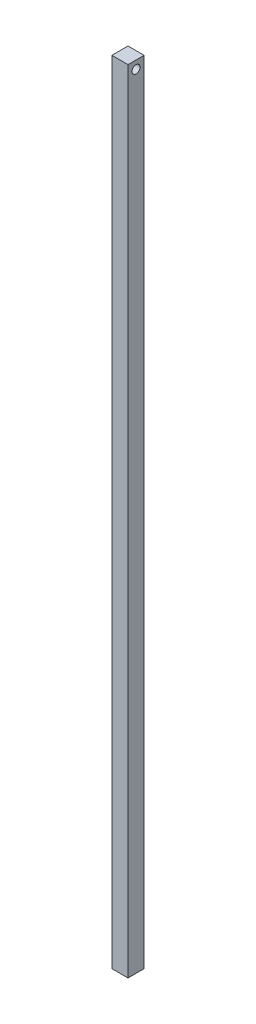
ISO-10303-21;
HEADER;
FILE_DESCRIPTION(('STEP AP214'),'2;1');
FILE_NAME('part.step','',(''),(''),'','','');
FILE_SCHEMA(('AUTOMOTIVE_DESIGN { 1 0 10303 214 1 1 1 1 }'));
ENDSEC;
DATA;
#1=APPLICATION_CONTEXT('core data for automotive mechanical design processes');
#2=APPLICATION_PROTOCOL_DEFINITION('international standard','automotive_design',2000,#1);
#3=PRODUCT_CONTEXT('',#1,'mechanical');
#4=PRODUCT('Part','Part','',(#3));
#5=PRODUCT_RELATED_PRODUCT_CATEGORY('part','',(#4));
#6=PRODUCT_DEFINITION_FORMATION('','',#4);
#7=PRODUCT_DEFINITION_CONTEXT('part definition',#1,'design');
#8=PRODUCT_DEFINITION('design','',#6,#7);
#9=PRODUCT_DEFINITION_SHAPE('','',#8);
#10=(LENGTH_UNIT() NAMED_UNIT(*) SI_UNIT(.MILLI.,.METRE.));
#11=(NAMED_UNIT(*) PLANE_ANGLE_UNIT() SI_UNIT($,.RADIAN.));
#12=(NAMED_UNIT(*) SI_UNIT($,.STERADIAN.) SOLID_ANGLE_UNIT());
#13=UNCERTAINTY_MEASURE_WITH_UNIT(LENGTH_MEASURE(1.E-05),#10,'distance_accuracy_value','');
#14=(GEOMETRIC_REPRESENTATION_CONTEXT(3) GLOBAL_UNCERTAINTY_ASSIGNED_CONTEXT((#13)) GLOBAL_UNIT_ASSIGNED_CONTEXT((#10,
#11,#12)) REPRESENTATION_CONTEXT('',''));
#15=CARTESIAN_POINT('',(0.,0.,0.));
#16=DIRECTION('',(0.,0.,1.));
#17=DIRECTION('',(1.,0.,0.));
#18=AXIS2_PLACEMENT_3D('',#15,#16,#17);
#19=CARTESIAN_POINT('',(-8.69613565640069,1244.6,-7.20330880498296));
#20=DIRECTION('',(1.,0.,0.));
#21=DIRECTION('',(0.,0.,-1.));
#22=AXIS2_PLACEMENT_3D('',#19,#20,#21);
#23=PLANE('',#22);
#24=CARTESIAN_POINT('',(-8.69613565640069,1231.9,5.49669119501704));
#25=DIRECTION('',(-1.,0.,0.));
#26=DIRECTION('',(0.,0.,1.));
#27=AXIS2_PLACEMENT_3D('',#24,#25,#26);
#28=CIRCLE('',#27,6.35);
#29=CARTESIAN_POINT('',(-8.69613565640069,1231.9,11.846691195017));
#30=VERTEX_POINT('',#29);
#31=EDGE_CURVE('E110',#30,#30,#28,.T.);
#32=ORIENTED_EDGE('',*,*,#31,.F.);
#33=EDGE_LOOP('',(#32));
#34=FACE_BOUND('',#33,.T.);
#35=DIRECTION('',(0.,0.,1.));
#36=VECTOR('',#35,1.);
#37=CARTESIAN_POINT('',(-8.69613565640069,0.,-7.20330880498296));
#38=LINE('',#37,#36);
#39=CARTESIAN_POINT('',(-8.69613565640069,0.,-7.20330880498296));
#40=VERTEX_POINT('',#39);
#41=CARTESIAN_POINT('',(-8.69613565640069,0.,18.196691195017));
#42=VERTEX_POINT('',#41);
#43=EDGE_CURVE('E96',#40,#42,#38,.T.);
#44=ORIENTED_EDGE('',*,*,#43,.T.);
#45=DIRECTION('',(0.,-1.,0.));
#46=VECTOR('',#45,1.);
#47=CARTESIAN_POINT('',(-8.69613565640069,1244.6,18.196691195017));
#48=LINE('',#47,#46);
#49=CARTESIAN_POINT('',(-8.69613565640069,1244.6,18.196691195017));
#50=VERTEX_POINT('',#49);
#51=EDGE_CURVE('E11',#50,#42,#48,.T.);
#52=ORIENTED_EDGE('',*,*,#51,.F.);
#53=DIRECTION('',(0.,0.,1.));
#54=VECTOR('',#53,1.);
#55=CARTESIAN_POINT('',(-8.69613565640069,1244.6,-7.20330880498296));
#56=LINE('',#55,#54);
#57=CARTESIAN_POINT('',(-8.69613565640069,1244.6,-7.20330880498296));
#58=VERTEX_POINT('',#57);
#59=EDGE_CURVE('E84',#58,#50,#56,.T.);
#60=ORIENTED_EDGE('',*,*,#59,.F.);
#61=DIRECTION('',(0.,-1.,0.));
#62=VECTOR('',#61,1.);
#63=CARTESIAN_POINT('',(-8.69613565640069,1244.6,-7.20330880498296));
#64=LINE('',#63,#62);
#65=EDGE_CURVE('E92',#58,#40,#64,.T.);
#66=ORIENTED_EDGE('',*,*,#65,.T.);
#67=EDGE_LOOP('',(#44,#52,#60,#66));
#68=FACE_BOUND('',#67,.T.);
#69=ADVANCED_FACE('F33',(#34,#68),#23,.F.);
#70=CARTESIAN_POINT('',(-8.69613565640069,1244.6,18.196691195017));
#71=DIRECTION('',(0.,0.,-1.));
#72=DIRECTION('',(-1.,0.,0.));
#73=AXIS2_PLACEMENT_3D('',#70,#71,#72);
#74=PLANE('',#73);
#75=DIRECTION('',(1.,0.,0.));
#76=VECTOR('',#75,1.);
#77=CARTESIAN_POINT('',(-8.69613565640069,0.,18.196691195017));
#78=LINE('',#77,#76);
#79=CARTESIAN_POINT('',(16.7038643435993,0.,18.196691195017));
#80=VERTEX_POINT('',#79);
#81=EDGE_CURVE('E88',#42,#80,#78,.T.);
#82=ORIENTED_EDGE('',*,*,#81,.T.);
#83=DIRECTION('',(0.,-1.,0.));
#84=VECTOR('',#83,1.);
#85=CARTESIAN_POINT('',(16.7038643435993,1244.6,18.196691195017));
#86=LINE('',#85,#84);
#87=CARTESIAN_POINT('',(16.7038643435993,1244.6,18.196691195017));
#88=VERTEX_POINT('',#87);
#89=EDGE_CURVE('E41',#88,#80,#86,.T.);
#90=ORIENTED_EDGE('',*,*,#89,.F.);
#91=DIRECTION('',(1.,0.,0.));
#92=VECTOR('',#91,1.);
#93=CARTESIAN_POINT('',(-8.69613565640069,1244.6,18.196691195017));
#94=LINE('',#93,#92);
#95=EDGE_CURVE('E79',#50,#88,#94,.T.);
#96=ORIENTED_EDGE('',*,*,#95,.F.);
#97=ORIENTED_EDGE('',*,*,#51,.T.);
#98=EDGE_LOOP('',(#82,#90,#96,#97));
#99=FACE_BOUND('',#98,.T.);
#100=ADVANCED_FACE('F87',(#99),#74,.F.);
#101=CARTESIAN_POINT('',(16.7038643435993,1244.6,-7.20330880498296));
#102=DIRECTION('',(-1.,0.,0.));
#103=DIRECTION('',(0.,0.,1.));
#104=AXIS2_PLACEMENT_3D('',#101,#102,#103);
#105=PLANE('',#104);
#106=CARTESIAN_POINT('',(16.7038643435993,1231.9,5.49669119501704));
#107=DIRECTION('',(-1.,0.,0.));
#108=DIRECTION('',(0.,0.,1.));
#109=AXIS2_PLACEMENT_3D('',#106,#107,#108);
#110=CIRCLE('',#109,6.35);
#111=CARTESIAN_POINT('',(16.7038643435993,1231.9,11.846691195017));
#112=VERTEX_POINT('',#111);
#113=EDGE_CURVE('E99',#112,#112,#110,.T.);
#114=ORIENTED_EDGE('',*,*,#113,.T.);
#115=EDGE_LOOP('',(#114));
#116=FACE_BOUND('',#115,.T.);
#117=DIRECTION('',(0.,0.,-1.));
#118=VECTOR('',#117,1.);
#119=CARTESIAN_POINT('',(16.7038643435993,0.,-7.20330880498296));
#120=LINE('',#119,#118);
#121=CARTESIAN_POINT('',(16.7038643435993,0.,-7.20330880498296));
#122=VERTEX_POINT('',#121);
#123=EDGE_CURVE('E66',#80,#122,#120,.T.);
#124=ORIENTED_EDGE('',*,*,#123,.T.);
#125=DIRECTION('',(0.,-1.,0.));
#126=VECTOR('',#125,1.);
#127=CARTESIAN_POINT('',(16.7038643435993,1244.6,-7.20330880498296));
#128=LINE('',#127,#126);
#129=CARTESIAN_POINT('',(16.7038643435993,1244.6,-7.20330880498296));
#130=VERTEX_POINT('',#129);
#131=EDGE_CURVE('E89',#130,#122,#128,.T.);
#132=ORIENTED_EDGE('',*,*,#131,.F.);
#133=DIRECTION('',(0.,0.,-1.));
#134=VECTOR('',#133,1.);
#135=CARTESIAN_POINT('',(16.7038643435993,1244.6,-7.20330880498296));
#136=LINE('',#135,#134);
#137=EDGE_CURVE('E82',#88,#130,#136,.T.);
#138=ORIENTED_EDGE('',*,*,#137,.F.);
#139=ORIENTED_EDGE('',*,*,#89,.T.);
#140=EDGE_LOOP('',(#124,#132,#138,#139));
#141=FACE_BOUND('',#140,.T.);
#142=ADVANCED_FACE('F90',(#116,#141),#105,.F.);
#143=CARTESIAN_POINT('',(-8.69613565640069,1244.6,-7.20330880498296));
#144=DIRECTION('',(0.,0.,1.));
#145=DIRECTION('',(1.,0.,0.));
#146=AXIS2_PLACEMENT_3D('',#143,#144,#145);
#147=PLANE('',#146);
#148=DIRECTION('',(-1.,0.,0.));
#149=VECTOR('',#148,1.);
#150=CARTESIAN_POINT('',(-8.69613565640069,0.,-7.20330880498296));
#151=LINE('',#150,#149);
#152=EDGE_CURVE('E72',#122,#40,#151,.T.);
#153=ORIENTED_EDGE('',*,*,#152,.T.);
#154=ORIENTED_EDGE('',*,*,#65,.F.);
#155=DIRECTION('',(-1.,0.,0.));
#156=VECTOR('',#155,1.);
#157=CARTESIAN_POINT('',(-8.69613565640069,1244.6,-7.20330880498296));
#158=LINE('',#157,#156);
#159=EDGE_CURVE('E49',#130,#58,#158,.T.);
#160=ORIENTED_EDGE('',*,*,#159,.F.);
#161=ORIENTED_EDGE('',*,*,#131,.T.);
#162=EDGE_LOOP('',(#153,#154,#160,#161));
#163=FACE_BOUND('',#162,.T.);
#164=ADVANCED_FACE('F104',(#163),#147,.F.);
#165=CARTESIAN_POINT('',(0.,1244.6,0.));
#166=DIRECTION('',(0.,1.,0.));
#167=DIRECTION('',(0.,0.,1.));
#168=AXIS2_PLACEMENT_3D('',#165,#166,#167);
#169=PLANE('',#168);
#170=ORIENTED_EDGE('',*,*,#59,.T.);
#171=ORIENTED_EDGE('',*,*,#95,.T.);
#172=ORIENTED_EDGE('',*,*,#137,.T.);
#173=ORIENTED_EDGE('',*,*,#159,.T.);
#174=EDGE_LOOP('',(#170,#171,#172,#173));
#175=FACE_BOUND('',#174,.T.);
#176=ADVANCED_FACE('F80',(#175),#169,.T.);
#177=CARTESIAN_POINT('',(0.,0.,0.));
#178=DIRECTION('',(0.,1.,0.));
#179=DIRECTION('',(0.,0.,1.));
#180=AXIS2_PLACEMENT_3D('',#177,#178,#179);
#181=PLANE('',#180);
#182=ORIENTED_EDGE('',*,*,#43,.F.);
#183=ORIENTED_EDGE('',*,*,#152,.F.);
#184=ORIENTED_EDGE('',*,*,#123,.F.);
#185=ORIENTED_EDGE('',*,*,#81,.F.);
#186=EDGE_LOOP('',(#182,#183,#184,#185));
#187=FACE_BOUND('',#186,.T.);
#188=ADVANCED_FACE('F107',(#187),#181,.F.);
#189=CARTESIAN_POINT('',(16.7038643435993,1231.9,5.49669119501704));
#190=DIRECTION('',(-1.,0.,0.));
#191=DIRECTION('',(0.,0.,1.));
#192=AXIS2_PLACEMENT_3D('',#189,#190,#191);
#193=CYLINDRICAL_SURFACE('',#192,6.35);
#194=ORIENTED_EDGE('',*,*,#113,.F.);
#195=EDGE_LOOP('',(#194));
#196=FACE_BOUND('',#195,.T.);
#197=ORIENTED_EDGE('',*,*,#31,.T.);
#198=EDGE_LOOP('',(#197));
#199=FACE_BOUND('',#198,.T.);
#200=ADVANCED_FACE('F117',(#196,#199),#193,.F.);
#201=CLOSED_SHELL('',(#69,#100,#142,#164,#176,#188,#200));
#202=MANIFOLD_SOLID_BREP('B2',#201);
#203=ADVANCED_BREP_SHAPE_REPRESENTATION('',(#18,#202),#14);
#204=SHAPE_DEFINITION_REPRESENTATION(#9,#203);
ENDSEC;
END-ISO-10303-21;
